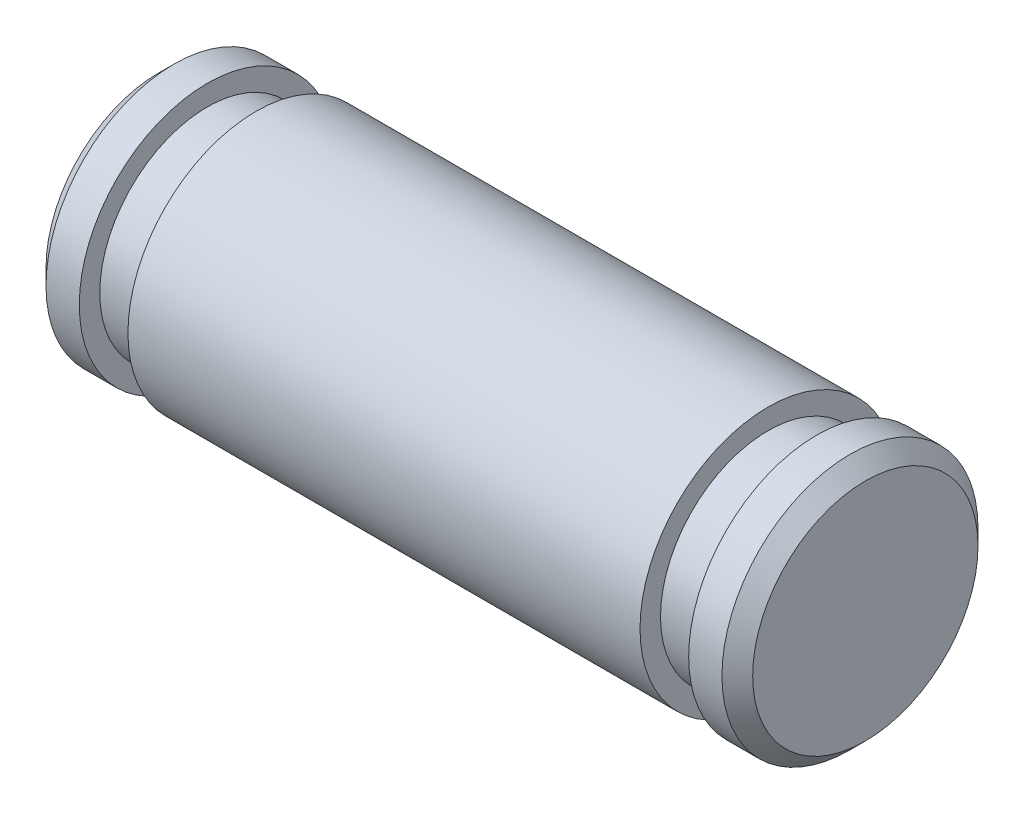
ISO-10303-21;
HEADER;
FILE_DESCRIPTION(('STEP AP214'),'2;1');
FILE_NAME('part.step','',(''),(''),'','','');
FILE_SCHEMA(('AUTOMOTIVE_DESIGN { 1 0 10303 214 1 1 1 1 }'));
ENDSEC;
DATA;
#1=APPLICATION_CONTEXT('core data for automotive mechanical design processes');
#2=APPLICATION_PROTOCOL_DEFINITION('international standard','automotive_design',2000,#1);
#3=PRODUCT_CONTEXT('',#1,'mechanical');
#4=PRODUCT('Part','Part','',(#3));
#5=PRODUCT_RELATED_PRODUCT_CATEGORY('part','',(#4));
#6=PRODUCT_DEFINITION_FORMATION('','',#4);
#7=PRODUCT_DEFINITION_CONTEXT('part definition',#1,'design');
#8=PRODUCT_DEFINITION('design','',#6,#7);
#9=PRODUCT_DEFINITION_SHAPE('','',#8);
#10=(LENGTH_UNIT() NAMED_UNIT(*) SI_UNIT(.MILLI.,.METRE.));
#11=(NAMED_UNIT(*) PLANE_ANGLE_UNIT() SI_UNIT($,.RADIAN.));
#12=(NAMED_UNIT(*) SI_UNIT($,.STERADIAN.) SOLID_ANGLE_UNIT());
#13=UNCERTAINTY_MEASURE_WITH_UNIT(LENGTH_MEASURE(1.E-05),#10,'distance_accuracy_value','');
#14=(GEOMETRIC_REPRESENTATION_CONTEXT(3) GLOBAL_UNCERTAINTY_ASSIGNED_CONTEXT((#13)) GLOBAL_UNIT_ASSIGNED_CONTEXT((#10,
#11,#12)) REPRESENTATION_CONTEXT('',''));
#15=CARTESIAN_POINT('',(0.,0.,0.));
#16=DIRECTION('',(0.,0.,1.));
#17=DIRECTION('',(1.,0.,0.));
#18=AXIS2_PLACEMENT_3D('',#15,#16,#17);
#19=CARTESIAN_POINT('',(8.763,2.794,0.));
#20=DIRECTION('',(-1.,0.,0.));
#21=DIRECTION('',(0.,0.,1.));
#22=AXIS2_PLACEMENT_3D('',#19,#20,#21);
#23=PLANE('',#22);
#24=CARTESIAN_POINT('',(8.76299999998764,0.,0.));
#25=DIRECTION('',(-1.,0.,0.));
#26=DIRECTION('',(0.,0.,1.));
#27=AXIS2_PLACEMENT_3D('',#24,#25,#26);
#28=CIRCLE('',#27,2.79399999993757);
#29=CARTESIAN_POINT('',(8.76299999998764,0.,2.79399999993757));
#30=VERTEX_POINT('',#29);
#31=EDGE_CURVE('E18',#30,#30,#28,.T.);
#32=ORIENTED_EDGE('',*,*,#31,.F.);
#33=EDGE_LOOP('',(#32));
#34=FACE_BOUND('',#33,.T.);
#35=ADVANCED_FACE('F15',(#34),#23,.F.);
#36=CARTESIAN_POINT('',(-8.763,0.,0.));
#37=DIRECTION('',(1.,0.,0.));
#38=DIRECTION('',(0.,0.,-1.));
#39=AXIS2_PLACEMENT_3D('',#36,#37,#38);
#40=PLANE('',#39);
#41=CARTESIAN_POINT('',(-8.76300000004449,0.,0.));
#42=DIRECTION('',(1.,0.,0.));
#43=DIRECTION('',(0.,0.,-1.));
#44=AXIS2_PLACEMENT_3D('',#41,#42,#43);
#45=CIRCLE('',#44,2.79399999999441);
#46=CARTESIAN_POINT('',(-8.76300000004449,0.,-2.79399999999441));
#47=VERTEX_POINT('',#46);
#48=EDGE_CURVE('E50',#47,#47,#45,.T.);
#49=ORIENTED_EDGE('',*,*,#48,.F.);
#50=EDGE_LOOP('',(#49));
#51=FACE_BOUND('',#50,.T.);
#52=ADVANCED_FACE('F62',(#51),#40,.F.);
#53=CARTESIAN_POINT('',(8.38199999992639,0.,0.));
#54=DIRECTION('',(-1.,0.,0.));
#55=DIRECTION('',(0.,0.,1.));
#56=AXIS2_PLACEMENT_3D('',#53,#54,#55);
#57=CONICAL_SURFACE('',#56,3.17499999999882,0.785398163397448);
#58=CARTESIAN_POINT('',(8.382,0.,0.));
#59=DIRECTION('',(-1.,0.,0.));
#60=DIRECTION('',(0.,0.,1.));
#61=AXIS2_PLACEMENT_3D('',#58,#59,#60);
#62=CIRCLE('',#61,3.175);
#63=CARTESIAN_POINT('',(8.382,0.,3.175));
#64=VERTEX_POINT('',#63);
#65=EDGE_CURVE('E52',#64,#64,#62,.T.);
#66=ORIENTED_EDGE('',*,*,#65,.F.);
#67=EDGE_LOOP('',(#66));
#68=FACE_BOUND('',#67,.T.);
#69=ORIENTED_EDGE('',*,*,#31,.T.);
#70=EDGE_LOOP('',(#69));
#71=FACE_BOUND('',#70,.T.);
#72=ADVANCED_FACE('F59',(#68,#71),#57,.T.);
#73=CARTESIAN_POINT('',(-8.38199999992639,0.,0.));
#74=DIRECTION('',(1.,0.,0.));
#75=DIRECTION('',(0.,0.,-1.));
#76=AXIS2_PLACEMENT_3D('',#73,#74,#75);
#77=CONICAL_SURFACE('',#76,3.1750000001125,0.785398163397448);
#78=ORIENTED_EDGE('',*,*,#48,.T.);
#79=EDGE_LOOP('',(#78));
#80=FACE_BOUND('',#79,.T.);
#81=CARTESIAN_POINT('',(-8.382,0.,0.));
#82=DIRECTION('',(-1.,0.,0.));
#83=DIRECTION('',(0.,0.,1.));
#84=AXIS2_PLACEMENT_3D('',#81,#82,#83);
#85=CIRCLE('',#84,3.175);
#86=CARTESIAN_POINT('',(-8.382,0.,3.175));
#87=VERTEX_POINT('',#86);
#88=EDGE_CURVE('E49',#87,#87,#85,.F.);
#89=ORIENTED_EDGE('',*,*,#88,.F.);
#90=EDGE_LOOP('',(#89));
#91=FACE_BOUND('',#90,.T.);
#92=ADVANCED_FACE('F106',(#80,#91),#77,.T.);
#93=CARTESIAN_POINT('',(8.763,0.,0.));
#94=DIRECTION('',(-1.,0.,0.));
#95=DIRECTION('',(0.,0.,1.));
#96=AXIS2_PLACEMENT_3D('',#93,#94,#95);
#97=CYLINDRICAL_SURFACE('',#96,3.175);
#98=CARTESIAN_POINT('',(7.5565,0.,0.));
#99=DIRECTION('',(-1.,0.,0.));
#100=DIRECTION('',(0.,0.,1.));
#101=AXIS2_PLACEMENT_3D('',#98,#99,#100);
#102=CIRCLE('',#101,3.175);
#103=CARTESIAN_POINT('',(7.5565,0.,3.175));
#104=VERTEX_POINT('',#103);
#105=EDGE_CURVE('E47',#104,#104,#102,.F.);
#106=ORIENTED_EDGE('',*,*,#105,.T.);
#107=EDGE_LOOP('',(#106));
#108=FACE_BOUND('',#107,.T.);
#109=ORIENTED_EDGE('',*,*,#65,.T.);
#110=EDGE_LOOP('',(#109));
#111=FACE_BOUND('',#110,.T.);
#112=ADVANCED_FACE('F102',(#108,#111),#97,.T.);
#113=CARTESIAN_POINT('',(8.763,0.,0.));
#114=DIRECTION('',(-1.,0.,0.));
#115=DIRECTION('',(0.,0.,1.));
#116=AXIS2_PLACEMENT_3D('',#113,#114,#115);
#117=CYLINDRICAL_SURFACE('',#116,3.175);
#118=ORIENTED_EDGE('',*,*,#88,.T.);
#119=EDGE_LOOP('',(#118));
#120=FACE_BOUND('',#119,.T.);
#121=CARTESIAN_POINT('',(-7.5565,0.,0.));
#122=DIRECTION('',(-1.,0.,0.));
#123=DIRECTION('',(0.,0.,1.));
#124=AXIS2_PLACEMENT_3D('',#121,#122,#123);
#125=CIRCLE('',#124,3.175);
#126=CARTESIAN_POINT('',(-7.5565,0.,3.175));
#127=VERTEX_POINT('',#126);
#128=EDGE_CURVE('E44',#127,#127,#125,.T.);
#129=ORIENTED_EDGE('',*,*,#128,.T.);
#130=EDGE_LOOP('',(#129));
#131=FACE_BOUND('',#130,.T.);
#132=ADVANCED_FACE('F98',(#120,#131),#117,.T.);
#133=CARTESIAN_POINT('',(7.5565,2.667,0.));
#134=DIRECTION('',(1.,0.,0.));
#135=DIRECTION('',(0.,0.,-1.));
#136=AXIS2_PLACEMENT_3D('',#133,#134,#135);
#137=PLANE('',#136);
#138=CARTESIAN_POINT('',(7.5565,0.,0.));
#139=DIRECTION('',(-1.,0.,0.));
#140=DIRECTION('',(0.,0.,1.));
#141=AXIS2_PLACEMENT_3D('',#138,#139,#140);
#142=CIRCLE('',#141,2.667);
#143=CARTESIAN_POINT('',(7.5565,0.,2.667));
#144=VERTEX_POINT('',#143);
#145=EDGE_CURVE('E41',#144,#144,#142,.T.);
#146=ORIENTED_EDGE('',*,*,#145,.F.);
#147=EDGE_LOOP('',(#146));
#148=FACE_BOUND('',#147,.T.);
#149=ORIENTED_EDGE('',*,*,#105,.F.);
#150=EDGE_LOOP('',(#149));
#151=FACE_BOUND('',#150,.T.);
#152=ADVANCED_FACE('F94',(#148,#151),#137,.F.);
#153=CARTESIAN_POINT('',(-7.5565,3.175,0.));
#154=DIRECTION('',(-1.,0.,0.));
#155=DIRECTION('',(0.,0.,1.));
#156=AXIS2_PLACEMENT_3D('',#153,#154,#155);
#157=PLANE('',#156);
#158=ORIENTED_EDGE('',*,*,#128,.F.);
#159=EDGE_LOOP('',(#158));
#160=FACE_BOUND('',#159,.T.);
#161=CARTESIAN_POINT('',(-7.5565,0.,0.));
#162=DIRECTION('',(-1.,0.,0.));
#163=DIRECTION('',(0.,0.,1.));
#164=AXIS2_PLACEMENT_3D('',#161,#162,#163);
#165=CIRCLE('',#164,2.667);
#166=CARTESIAN_POINT('',(-7.5565,0.,2.667));
#167=VERTEX_POINT('',#166);
#168=EDGE_CURVE('E38',#167,#167,#165,.F.);
#169=ORIENTED_EDGE('',*,*,#168,.F.);
#170=EDGE_LOOP('',(#169));
#171=FACE_BOUND('',#170,.T.);
#172=ADVANCED_FACE('F90',(#160,#171),#157,.F.);
#173=CARTESIAN_POINT('',(8.763,0.,0.));
#174=DIRECTION('',(-1.,0.,0.));
#175=DIRECTION('',(0.,0.,1.));
#176=AXIS2_PLACEMENT_3D('',#173,#174,#175);
#177=CYLINDRICAL_SURFACE('',#176,2.667);
#178=CARTESIAN_POINT('',(6.35,0.,0.));
#179=DIRECTION('',(-1.,0.,0.));
#180=DIRECTION('',(0.,0.,1.));
#181=AXIS2_PLACEMENT_3D('',#178,#179,#180);
#182=CIRCLE('',#181,2.667);
#183=CARTESIAN_POINT('',(6.35,0.,2.667));
#184=VERTEX_POINT('',#183);
#185=EDGE_CURVE('E35',#184,#184,#182,.F.);
#186=ORIENTED_EDGE('',*,*,#185,.T.);
#187=EDGE_LOOP('',(#186));
#188=FACE_BOUND('',#187,.T.);
#189=ORIENTED_EDGE('',*,*,#145,.T.);
#190=EDGE_LOOP('',(#189));
#191=FACE_BOUND('',#190,.T.);
#192=ADVANCED_FACE('F86',(#188,#191),#177,.T.);
#193=CARTESIAN_POINT('',(8.763,0.,0.));
#194=DIRECTION('',(-1.,0.,0.));
#195=DIRECTION('',(0.,0.,1.));
#196=AXIS2_PLACEMENT_3D('',#193,#194,#195);
#197=CYLINDRICAL_SURFACE('',#196,2.667);
#198=ORIENTED_EDGE('',*,*,#168,.T.);
#199=EDGE_LOOP('',(#198));
#200=FACE_BOUND('',#199,.T.);
#201=CARTESIAN_POINT('',(-6.35,0.,0.));
#202=DIRECTION('',(-1.,0.,0.));
#203=DIRECTION('',(0.,0.,1.));
#204=AXIS2_PLACEMENT_3D('',#201,#202,#203);
#205=CIRCLE('',#204,2.667);
#206=CARTESIAN_POINT('',(-6.35,0.,2.667));
#207=VERTEX_POINT('',#206);
#208=EDGE_CURVE('E27',#207,#207,#205,.T.);
#209=ORIENTED_EDGE('',*,*,#208,.T.);
#210=EDGE_LOOP('',(#209));
#211=FACE_BOUND('',#210,.T.);
#212=ADVANCED_FACE('F82',(#200,#211),#197,.T.);
#213=CARTESIAN_POINT('',(6.35,3.175,0.));
#214=DIRECTION('',(-1.,0.,0.));
#215=DIRECTION('',(0.,0.,1.));
#216=AXIS2_PLACEMENT_3D('',#213,#214,#215);
#217=PLANE('',#216);
#218=CARTESIAN_POINT('',(6.35,0.,0.));
#219=DIRECTION('',(-1.,0.,0.));
#220=DIRECTION('',(0.,0.,1.));
#221=AXIS2_PLACEMENT_3D('',#218,#219,#220);
#222=CIRCLE('',#221,3.175);
#223=CARTESIAN_POINT('',(6.35,0.,3.175));
#224=VERTEX_POINT('',#223);
#225=EDGE_CURVE('E22',#224,#224,#222,.T.);
#226=ORIENTED_EDGE('',*,*,#225,.F.);
#227=EDGE_LOOP('',(#226));
#228=FACE_BOUND('',#227,.T.);
#229=ORIENTED_EDGE('',*,*,#185,.F.);
#230=EDGE_LOOP('',(#229));
#231=FACE_BOUND('',#230,.T.);
#232=ADVANCED_FACE('F75',(#228,#231),#217,.F.);
#233=CARTESIAN_POINT('',(-6.35,2.667,0.));
#234=DIRECTION('',(1.,0.,0.));
#235=DIRECTION('',(0.,0.,-1.));
#236=AXIS2_PLACEMENT_3D('',#233,#234,#235);
#237=PLANE('',#236);
#238=ORIENTED_EDGE('',*,*,#208,.F.);
#239=EDGE_LOOP('',(#238));
#240=FACE_BOUND('',#239,.T.);
#241=CARTESIAN_POINT('',(-6.35,0.,0.));
#242=DIRECTION('',(-1.,0.,0.));
#243=DIRECTION('',(0.,0.,1.));
#244=AXIS2_PLACEMENT_3D('',#241,#242,#243);
#245=CIRCLE('',#244,3.175);
#246=CARTESIAN_POINT('',(-6.35,0.,3.175));
#247=VERTEX_POINT('',#246);
#248=EDGE_CURVE('E10',#247,#247,#245,.F.);
#249=ORIENTED_EDGE('',*,*,#248,.F.);
#250=EDGE_LOOP('',(#249));
#251=FACE_BOUND('',#250,.T.);
#252=ADVANCED_FACE('F70',(#240,#251),#237,.F.);
#253=CARTESIAN_POINT('',(8.763,0.,0.));
#254=DIRECTION('',(-1.,0.,0.));
#255=DIRECTION('',(0.,0.,1.));
#256=AXIS2_PLACEMENT_3D('',#253,#254,#255);
#257=CYLINDRICAL_SURFACE('',#256,3.175);
#258=ORIENTED_EDGE('',*,*,#248,.T.);
#259=EDGE_LOOP('',(#258));
#260=FACE_BOUND('',#259,.T.);
#261=ORIENTED_EDGE('',*,*,#225,.T.);
#262=EDGE_LOOP('',(#261));
#263=FACE_BOUND('',#262,.T.);
#264=ADVANCED_FACE('F68',(#260,#263),#257,.T.);
#265=CLOSED_SHELL('',(#35,#52,#72,#92,#112,#132,#152,#172,#192,#212,#232,#252,#264));
#266=MANIFOLD_SOLID_BREP('B1',#265);
#267=ADVANCED_BREP_SHAPE_REPRESENTATION('',(#18,#266),#14);
#268=SHAPE_DEFINITION_REPRESENTATION(#9,#267);
ENDSEC;
END-ISO-10303-21;
